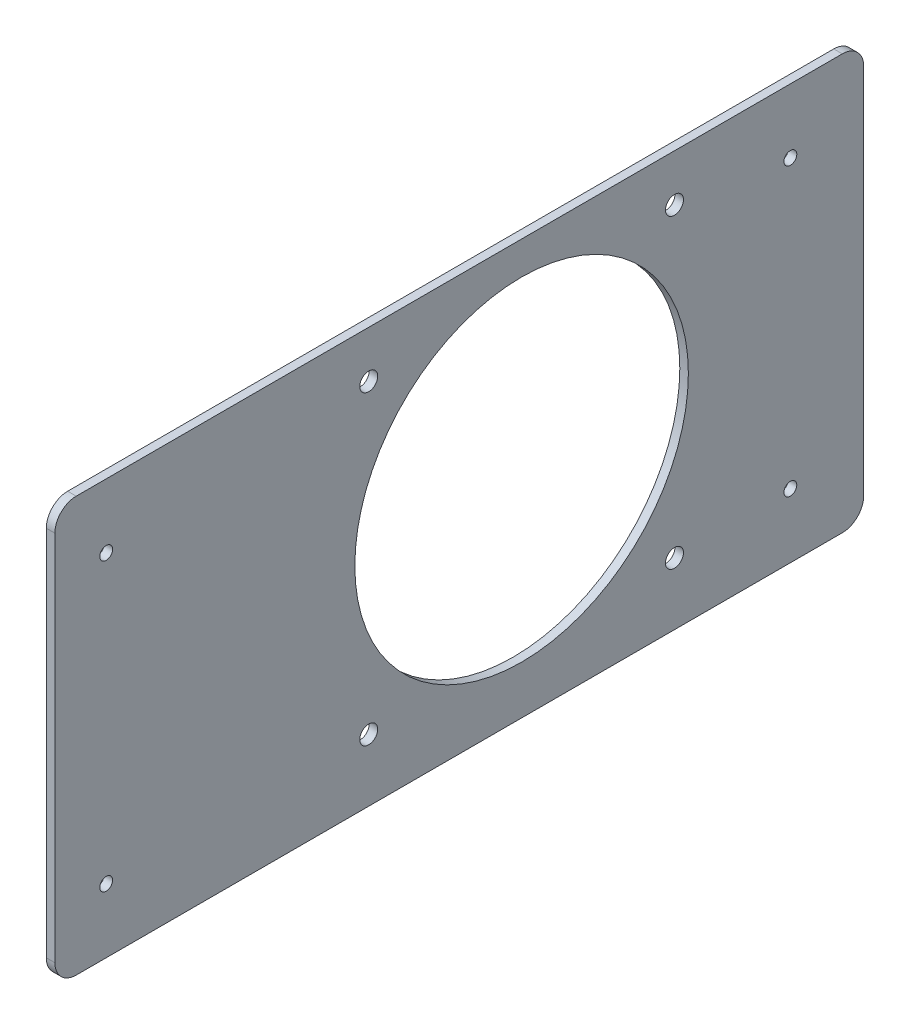
ISO-10303-21;
HEADER;
FILE_DESCRIPTION(('STEP AP214'),'2;1');
FILE_NAME('part.step','',(''),(''),'','','');
FILE_SCHEMA(('AUTOMOTIVE_DESIGN { 1 0 10303 214 1 1 1 1 }'));
ENDSEC;
DATA;
#1=APPLICATION_CONTEXT('core data for automotive mechanical design processes');
#2=APPLICATION_PROTOCOL_DEFINITION('international standard','automotive_design',2000,#1);
#3=PRODUCT_CONTEXT('',#1,'mechanical');
#4=PRODUCT('Part','Part','',(#3));
#5=PRODUCT_RELATED_PRODUCT_CATEGORY('part','',(#4));
#6=PRODUCT_DEFINITION_FORMATION('','',#4);
#7=PRODUCT_DEFINITION_CONTEXT('part definition',#1,'design');
#8=PRODUCT_DEFINITION('design','',#6,#7);
#9=PRODUCT_DEFINITION_SHAPE('','',#8);
#10=(LENGTH_UNIT() NAMED_UNIT(*) SI_UNIT(.MILLI.,.METRE.));
#11=(NAMED_UNIT(*) PLANE_ANGLE_UNIT() SI_UNIT($,.RADIAN.));
#12=(NAMED_UNIT(*) SI_UNIT($,.STERADIAN.) SOLID_ANGLE_UNIT());
#13=UNCERTAINTY_MEASURE_WITH_UNIT(LENGTH_MEASURE(1.E-05),#10,'distance_accuracy_value','');
#14=(GEOMETRIC_REPRESENTATION_CONTEXT(3) GLOBAL_UNCERTAINTY_ASSIGNED_CONTEXT((#13)) GLOBAL_UNIT_ASSIGNED_CONTEXT((#10,
#11,#12)) REPRESENTATION_CONTEXT('',''));
#15=CARTESIAN_POINT('',(0.,0.,0.));
#16=DIRECTION('',(0.,0.,1.));
#17=DIRECTION('',(1.,0.,0.));
#18=AXIS2_PLACEMENT_3D('',#15,#16,#17);
#19=CARTESIAN_POINT('',(-2.,-3.,-125.));
#20=DIRECTION('',(0.,0.,-1.));
#21=DIRECTION('',(0.,1.,0.));
#22=AXIS2_PLACEMENT_3D('',#19,#20,#21);
#23=PLANE('',#22);
#24=DIRECTION('',(0.,1.,0.));
#25=VECTOR('',#24,1.);
#26=CARTESIAN_POINT('',(-2.,-3.,-125.));
#27=LINE('',#26,#25);
#28=CARTESIAN_POINT('',(-2.,2.,-125.));
#29=VERTEX_POINT('',#28);
#30=CARTESIAN_POINT('',(-2.,89.,-125.));
#31=VERTEX_POINT('',#30);
#32=EDGE_CURVE('E187',#29,#31,#27,.T.);
#33=ORIENTED_EDGE('',*,*,#32,.T.);
#34=DIRECTION('',(1.,0.,0.));
#35=VECTOR('',#34,1.);
#36=CARTESIAN_POINT('',(-2.,89.,-125.));
#37=LINE('',#36,#35);
#38=CARTESIAN_POINT('',(0.,89.,-125.));
#39=VERTEX_POINT('',#38);
#40=EDGE_CURVE('E125',#31,#39,#37,.T.);
#41=ORIENTED_EDGE('',*,*,#40,.T.);
#42=DIRECTION('',(0.,1.,0.));
#43=VECTOR('',#42,1.);
#44=CARTESIAN_POINT('',(0.,-3.,-125.));
#45=LINE('',#44,#43);
#46=CARTESIAN_POINT('',(0.,2.,-125.));
#47=VERTEX_POINT('',#46);
#48=EDGE_CURVE('E117',#47,#39,#45,.T.);
#49=ORIENTED_EDGE('',*,*,#48,.F.);
#50=DIRECTION('',(1.,0.,0.));
#51=VECTOR('',#50,1.);
#52=CARTESIAN_POINT('',(-2.,2.,-125.));
#53=LINE('',#52,#51);
#54=EDGE_CURVE('E130',#47,#29,#53,.F.);
#55=ORIENTED_EDGE('',*,*,#54,.T.);
#56=EDGE_LOOP('',(#33,#41,#49,#55));
#57=FACE_BOUND('',#56,.T.);
#58=ADVANCED_FACE('F45',(#57),#23,.T.);
#59=CARTESIAN_POINT('',(-2.,-3.,64.1471528727021));
#60=DIRECTION('',(0.,-1.,0.));
#61=DIRECTION('',(0.,0.,-1.));
#62=AXIS2_PLACEMENT_3D('',#59,#60,#61);
#63=PLANE('',#62);
#64=DIRECTION('',(0.,0.,-1.));
#65=VECTOR('',#64,1.);
#66=CARTESIAN_POINT('',(0.,-3.,64.1471528727021));
#67=LINE('',#66,#65);
#68=CARTESIAN_POINT('',(0.,-3.,59.1471528727021));
#69=VERTEX_POINT('',#68);
#70=CARTESIAN_POINT('',(0.,-3.,-120.));
#71=VERTEX_POINT('',#70);
#72=EDGE_CURVE('E119',#69,#71,#67,.T.);
#73=ORIENTED_EDGE('',*,*,#72,.F.);
#74=DIRECTION('',(1.,0.,0.));
#75=VECTOR('',#74,1.);
#76=CARTESIAN_POINT('',(-2.,-3.,59.1471528727021));
#77=LINE('',#76,#75);
#78=CARTESIAN_POINT('',(-2.,-3.,59.1471528727021));
#79=VERTEX_POINT('',#78);
#80=EDGE_CURVE('E11',#69,#79,#77,.F.);
#81=ORIENTED_EDGE('',*,*,#80,.T.);
#82=DIRECTION('',(0.,0.,-1.));
#83=VECTOR('',#82,1.);
#84=CARTESIAN_POINT('',(-2.,-3.,64.1471528727021));
#85=LINE('',#84,#83);
#86=CARTESIAN_POINT('',(-2.,-3.,-120.));
#87=VERTEX_POINT('',#86);
#88=EDGE_CURVE('E139',#79,#87,#85,.T.);
#89=ORIENTED_EDGE('',*,*,#88,.T.);
#90=DIRECTION('',(1.,0.,0.));
#91=VECTOR('',#90,1.);
#92=CARTESIAN_POINT('',(-2.,-3.,-120.));
#93=LINE('',#92,#91);
#94=EDGE_CURVE('E53',#87,#71,#93,.T.);
#95=ORIENTED_EDGE('',*,*,#94,.T.);
#96=EDGE_LOOP('',(#73,#81,#89,#95));
#97=FACE_BOUND('',#96,.T.);
#98=ADVANCED_FACE('F173',(#97),#63,.T.);
#99=CARTESIAN_POINT('',(-2.,94.,64.1471528727021));
#100=DIRECTION('',(0.,0.,1.));
#101=DIRECTION('',(1.,0.,0.));
#102=AXIS2_PLACEMENT_3D('',#99,#100,#101);
#103=PLANE('',#102);
#104=DIRECTION('',(0.,-1.,0.));
#105=VECTOR('',#104,1.);
#106=CARTESIAN_POINT('',(0.,94.,64.1471528727021));
#107=LINE('',#106,#105);
#108=CARTESIAN_POINT('',(0.,89.,64.1471528727021));
#109=VERTEX_POINT('',#108);
#110=CARTESIAN_POINT('',(0.,2.,64.1471528727021));
#111=VERTEX_POINT('',#110);
#112=EDGE_CURVE('E182',#109,#111,#107,.T.);
#113=ORIENTED_EDGE('',*,*,#112,.F.);
#114=DIRECTION('',(1.,0.,0.));
#115=VECTOR('',#114,1.);
#116=CARTESIAN_POINT('',(-2.,89.,64.1471528727021));
#117=LINE('',#116,#115);
#118=CARTESIAN_POINT('',(-2.,89.,64.1471528727021));
#119=VERTEX_POINT('',#118);
#120=EDGE_CURVE('E67',#109,#119,#117,.F.);
#121=ORIENTED_EDGE('',*,*,#120,.T.);
#122=DIRECTION('',(0.,-1.,0.));
#123=VECTOR('',#122,1.);
#124=CARTESIAN_POINT('',(-2.,94.,64.1471528727021));
#125=LINE('',#124,#123);
#126=CARTESIAN_POINT('',(-2.,2.,64.1471528727021));
#127=VERTEX_POINT('',#126);
#128=EDGE_CURVE('E145',#119,#127,#125,.T.);
#129=ORIENTED_EDGE('',*,*,#128,.T.);
#130=DIRECTION('',(1.,0.,0.));
#131=VECTOR('',#130,1.);
#132=CARTESIAN_POINT('',(-2.,2.,64.1471528727021));
#133=LINE('',#132,#131);
#134=EDGE_CURVE('E169',#127,#111,#133,.T.);
#135=ORIENTED_EDGE('',*,*,#134,.T.);
#136=EDGE_LOOP('',(#113,#121,#129,#135));
#137=FACE_BOUND('',#136,.T.);
#138=ADVANCED_FACE('F181',(#137),#103,.T.);
#139=CARTESIAN_POINT('',(-2.,94.,-125.));
#140=DIRECTION('',(0.,1.,0.));
#141=DIRECTION('',(0.,0.,1.));
#142=AXIS2_PLACEMENT_3D('',#139,#140,#141);
#143=PLANE('',#142);
#144=DIRECTION('',(0.,0.,1.));
#145=VECTOR('',#144,1.);
#146=CARTESIAN_POINT('',(0.,94.,-125.));
#147=LINE('',#146,#145);
#148=CARTESIAN_POINT('',(0.,94.,-120.));
#149=VERTEX_POINT('',#148);
#150=CARTESIAN_POINT('',(0.,94.,59.147152872702));
#151=VERTEX_POINT('',#150);
#152=EDGE_CURVE('E134',#149,#151,#147,.T.);
#153=ORIENTED_EDGE('',*,*,#152,.F.);
#154=DIRECTION('',(1.,0.,0.));
#155=VECTOR('',#154,1.);
#156=CARTESIAN_POINT('',(-2.,94.,-120.));
#157=LINE('',#156,#155);
#158=CARTESIAN_POINT('',(-2.,94.,-120.));
#159=VERTEX_POINT('',#158);
#160=EDGE_CURVE('E159',#149,#159,#157,.F.);
#161=ORIENTED_EDGE('',*,*,#160,.T.);
#162=DIRECTION('',(0.,0.,1.));
#163=VECTOR('',#162,1.);
#164=CARTESIAN_POINT('',(-2.,94.,-125.));
#165=LINE('',#164,#163);
#166=CARTESIAN_POINT('',(-2.,94.,59.147152872702));
#167=VERTEX_POINT('',#166);
#168=EDGE_CURVE('E193',#159,#167,#165,.T.);
#169=ORIENTED_EDGE('',*,*,#168,.T.);
#170=DIRECTION('',(1.,0.,0.));
#171=VECTOR('',#170,1.);
#172=CARTESIAN_POINT('',(-2.,94.,59.1471528727021));
#173=LINE('',#172,#171);
#174=EDGE_CURVE('E156',#167,#151,#173,.T.);
#175=ORIENTED_EDGE('',*,*,#174,.T.);
#176=EDGE_LOOP('',(#153,#161,#169,#175));
#177=FACE_BOUND('',#176,.T.);
#178=ADVANCED_FACE('F291',(#177),#143,.T.);
#179=CARTESIAN_POINT('',(-2.,0.,0.));
#180=DIRECTION('',(1.,0.,0.));
#181=DIRECTION('',(0.,0.,-1.));
#182=AXIS2_PLACEMENT_3D('',#179,#180,#181);
#183=PLANE('',#182);
#184=CARTESIAN_POINT('',(-2.,79.,-107.852847127298));
#185=DIRECTION('',(1.,0.,0.));
#186=DIRECTION('',(0.,0.,-1.));
#187=AXIS2_PLACEMENT_3D('',#184,#185,#186);
#188=CIRCLE('',#187,1.50000000000003);
#189=CARTESIAN_POINT('',(-2.,79.,-109.352847127298));
#190=VERTEX_POINT('',#189);
#191=EDGE_CURVE('E245',#190,#190,#188,.T.);
#192=ORIENTED_EDGE('',*,*,#191,.T.);
#193=EDGE_LOOP('',(#192));
#194=FACE_BOUND('',#193,.T.);
#195=CARTESIAN_POINT('',(-2.,12.,-107.852847127298));
#196=DIRECTION('',(1.,0.,0.));
#197=DIRECTION('',(0.,0.,-1.));
#198=AXIS2_PLACEMENT_3D('',#195,#196,#197);
#199=CIRCLE('',#198,1.50000000000003);
#200=CARTESIAN_POINT('',(-2.,12.,-109.352847127298));
#201=VERTEX_POINT('',#200);
#202=EDGE_CURVE('E250',#201,#201,#199,.T.);
#203=ORIENTED_EDGE('',*,*,#202,.T.);
#204=EDGE_LOOP('',(#203));
#205=FACE_BOUND('',#204,.T.);
#206=CARTESIAN_POINT('',(-2.,12.,52.1471528727021));
#207=DIRECTION('',(1.,0.,0.));
#208=DIRECTION('',(0.,0.,-1.));
#209=AXIS2_PLACEMENT_3D('',#206,#207,#208);
#210=CIRCLE('',#209,1.5);
#211=CARTESIAN_POINT('',(-2.,12.,50.6471528727021));
#212=VERTEX_POINT('',#211);
#213=EDGE_CURVE('E229',#212,#212,#210,.T.);
#214=ORIENTED_EDGE('',*,*,#213,.T.);
#215=EDGE_LOOP('',(#214));
#216=FACE_BOUND('',#215,.T.);
#217=CARTESIAN_POINT('',(-2.,79.,52.1471528727021));
#218=DIRECTION('',(1.,0.,0.));
#219=DIRECTION('',(0.,0.,-1.));
#220=AXIS2_PLACEMENT_3D('',#217,#218,#219);
#221=CIRCLE('',#220,1.5);
#222=CARTESIAN_POINT('',(-2.,79.,50.6471528727021));
#223=VERTEX_POINT('',#222);
#224=EDGE_CURVE('E237',#223,#223,#221,.T.);
#225=ORIENTED_EDGE('',*,*,#224,.T.);
#226=EDGE_LOOP('',(#225));
#227=FACE_BOUND('',#226,.T.);
#228=CARTESIAN_POINT('',(-2.,11.55,-9.24999999999999));
#229=DIRECTION('',(1.,0.,0.));
#230=DIRECTION('',(0.,0.,-1.));
#231=AXIS2_PLACEMENT_3D('',#228,#229,#230);
#232=CIRCLE('',#231,2.1);
#233=CARTESIAN_POINT('',(-2.,11.55,-11.35));
#234=VERTEX_POINT('',#233);
#235=EDGE_CURVE('E214',#234,#234,#232,.T.);
#236=ORIENTED_EDGE('',*,*,#235,.T.);
#237=EDGE_LOOP('',(#236));
#238=FACE_BOUND('',#237,.T.);
#239=CARTESIAN_POINT('',(-2.,11.55,-80.75));
#240=DIRECTION('',(1.,0.,0.));
#241=DIRECTION('',(0.,0.,-1.));
#242=AXIS2_PLACEMENT_3D('',#239,#240,#241);
#243=CIRCLE('',#242,2.1);
#244=CARTESIAN_POINT('',(-2.,11.55,-82.85));
#245=VERTEX_POINT('',#244);
#246=EDGE_CURVE('E217',#245,#245,#243,.T.);
#247=ORIENTED_EDGE('',*,*,#246,.T.);
#248=EDGE_LOOP('',(#247));
#249=FACE_BOUND('',#248,.T.);
#250=CARTESIAN_POINT('',(-2.,83.05,-80.75));
#251=DIRECTION('',(1.,0.,0.));
#252=DIRECTION('',(0.,0.,-1.));
#253=AXIS2_PLACEMENT_3D('',#250,#251,#252);
#254=CIRCLE('',#253,2.1);
#255=CARTESIAN_POINT('',(-2.,83.05,-82.85));
#256=VERTEX_POINT('',#255);
#257=EDGE_CURVE('E220',#256,#256,#254,.T.);
#258=ORIENTED_EDGE('',*,*,#257,.T.);
#259=EDGE_LOOP('',(#258));
#260=FACE_BOUND('',#259,.T.);
#261=CARTESIAN_POINT('',(-2.,83.05,-9.24999999999999));
#262=DIRECTION('',(1.,0.,0.));
#263=DIRECTION('',(0.,0.,-1.));
#264=AXIS2_PLACEMENT_3D('',#261,#262,#263);
#265=CIRCLE('',#264,2.1);
#266=CARTESIAN_POINT('',(-2.,83.05,-11.35));
#267=VERTEX_POINT('',#266);
#268=EDGE_CURVE('E206',#267,#267,#265,.T.);
#269=ORIENTED_EDGE('',*,*,#268,.T.);
#270=EDGE_LOOP('',(#269));
#271=FACE_BOUND('',#270,.T.);
#272=CARTESIAN_POINT('',(-2.,47.3,-45.));
#273=DIRECTION('',(1.,0.,0.));
#274=DIRECTION('',(0.,0.,-1.));
#275=AXIS2_PLACEMENT_3D('',#272,#273,#274);
#276=CIRCLE('',#275,39.);
#277=CARTESIAN_POINT('',(-2.,47.3,-84.));
#278=VERTEX_POINT('',#277);
#279=EDGE_CURVE('E135',#278,#278,#276,.T.);
#280=ORIENTED_EDGE('',*,*,#279,.T.);
#281=EDGE_LOOP('',(#280));
#282=FACE_BOUND('',#281,.T.);
#283=ORIENTED_EDGE('',*,*,#168,.F.);
#284=CARTESIAN_POINT('',(-2.,89.,-120.));
#285=DIRECTION('',(1.,0.,0.));
#286=DIRECTION('',(0.,0.,-1.));
#287=AXIS2_PLACEMENT_3D('',#284,#285,#286);
#288=CIRCLE('',#287,5.);
#289=EDGE_CURVE('E166',#159,#31,#288,.F.);
#290=ORIENTED_EDGE('',*,*,#289,.T.);
#291=ORIENTED_EDGE('',*,*,#32,.F.);
#292=CARTESIAN_POINT('',(-2.,2.,-120.));
#293=DIRECTION('',(1.,0.,0.));
#294=DIRECTION('',(0.,0.,-1.));
#295=AXIS2_PLACEMENT_3D('',#292,#293,#294);
#296=CIRCLE('',#295,5.);
#297=EDGE_CURVE('E138',#29,#87,#296,.F.);
#298=ORIENTED_EDGE('',*,*,#297,.T.);
#299=ORIENTED_EDGE('',*,*,#88,.F.);
#300=CARTESIAN_POINT('',(-2.,2.,59.1471528727021));
#301=DIRECTION('',(1.,0.,0.));
#302=DIRECTION('',(0.,0.,-1.));
#303=AXIS2_PLACEMENT_3D('',#300,#301,#302);
#304=CIRCLE('',#303,5.);
#305=EDGE_CURVE('E60',#79,#127,#304,.F.);
#306=ORIENTED_EDGE('',*,*,#305,.T.);
#307=ORIENTED_EDGE('',*,*,#128,.F.);
#308=CARTESIAN_POINT('',(-2.,89.,59.1471528727021));
#309=DIRECTION('',(1.,0.,0.));
#310=DIRECTION('',(0.,0.,-1.));
#311=AXIS2_PLACEMENT_3D('',#308,#309,#310);
#312=CIRCLE('',#311,5.);
#313=EDGE_CURVE('E164',#119,#167,#312,.F.);
#314=ORIENTED_EDGE('',*,*,#313,.T.);
#315=EDGE_LOOP('',(#283,#290,#291,#298,#299,#306,#307,#314));
#316=FACE_BOUND('',#315,.T.);
#317=ADVANCED_FACE('F176',(#194,#205,#216,#227,#238,#249,#260,#271,#282,#316),#183,.F.);
#318=CARTESIAN_POINT('',(0.,0.,0.));
#319=DIRECTION('',(1.,0.,0.));
#320=DIRECTION('',(0.,0.,-1.));
#321=AXIS2_PLACEMENT_3D('',#318,#319,#320);
#322=PLANE('',#321);
#323=CARTESIAN_POINT('',(0.,79.,-107.852847127298));
#324=DIRECTION('',(1.,0.,0.));
#325=DIRECTION('',(0.,0.,-1.));
#326=AXIS2_PLACEMENT_3D('',#323,#324,#325);
#327=CIRCLE('',#326,1.50000000000003);
#328=CARTESIAN_POINT('',(0.,79.,-109.352847127298));
#329=VERTEX_POINT('',#328);
#330=EDGE_CURVE('E253',#329,#329,#327,.T.);
#331=ORIENTED_EDGE('',*,*,#330,.F.);
#332=EDGE_LOOP('',(#331));
#333=FACE_BOUND('',#332,.T.);
#334=CARTESIAN_POINT('',(0.,12.,-107.852847127298));
#335=DIRECTION('',(1.,0.,0.));
#336=DIRECTION('',(0.,0.,-1.));
#337=AXIS2_PLACEMENT_3D('',#334,#335,#336);
#338=CIRCLE('',#337,1.50000000000003);
#339=CARTESIAN_POINT('',(0.,12.,-109.352847127298));
#340=VERTEX_POINT('',#339);
#341=EDGE_CURVE('E254',#340,#340,#338,.T.);
#342=ORIENTED_EDGE('',*,*,#341,.F.);
#343=EDGE_LOOP('',(#342));
#344=FACE_BOUND('',#343,.T.);
#345=CARTESIAN_POINT('',(0.,12.,52.1471528727021));
#346=DIRECTION('',(1.,0.,0.));
#347=DIRECTION('',(0.,0.,-1.));
#348=AXIS2_PLACEMENT_3D('',#345,#346,#347);
#349=CIRCLE('',#348,1.5);
#350=CARTESIAN_POINT('',(0.,12.,50.6471528727021));
#351=VERTEX_POINT('',#350);
#352=EDGE_CURVE('E241',#351,#351,#349,.T.);
#353=ORIENTED_EDGE('',*,*,#352,.F.);
#354=EDGE_LOOP('',(#353));
#355=FACE_BOUND('',#354,.T.);
#356=CARTESIAN_POINT('',(0.,79.,52.1471528727021));
#357=DIRECTION('',(1.,0.,0.));
#358=DIRECTION('',(0.,0.,-1.));
#359=AXIS2_PLACEMENT_3D('',#356,#357,#358);
#360=CIRCLE('',#359,1.5);
#361=CARTESIAN_POINT('',(0.,79.,50.6471528727021));
#362=VERTEX_POINT('',#361);
#363=EDGE_CURVE('E242',#362,#362,#360,.T.);
#364=ORIENTED_EDGE('',*,*,#363,.F.);
#365=EDGE_LOOP('',(#364));
#366=FACE_BOUND('',#365,.T.);
#367=CARTESIAN_POINT('',(0.,11.55,-9.24999999999999));
#368=DIRECTION('',(1.,0.,0.));
#369=DIRECTION('',(0.,0.,-1.));
#370=AXIS2_PLACEMENT_3D('',#367,#368,#369);
#371=CIRCLE('',#370,2.1);
#372=CARTESIAN_POINT('',(0.,11.55,-11.35));
#373=VERTEX_POINT('',#372);
#374=EDGE_CURVE('E225',#373,#373,#371,.T.);
#375=ORIENTED_EDGE('',*,*,#374,.F.);
#376=EDGE_LOOP('',(#375));
#377=FACE_BOUND('',#376,.T.);
#378=CARTESIAN_POINT('',(0.,11.55,-80.75));
#379=DIRECTION('',(1.,0.,0.));
#380=DIRECTION('',(0.,0.,-1.));
#381=AXIS2_PLACEMENT_3D('',#378,#379,#380);
#382=CIRCLE('',#381,2.1);
#383=CARTESIAN_POINT('',(0.,11.55,-82.85));
#384=VERTEX_POINT('',#383);
#385=EDGE_CURVE('E228',#384,#384,#382,.T.);
#386=ORIENTED_EDGE('',*,*,#385,.F.);
#387=EDGE_LOOP('',(#386));
#388=FACE_BOUND('',#387,.T.);
#389=CARTESIAN_POINT('',(0.,83.05,-80.75));
#390=DIRECTION('',(1.,0.,0.));
#391=DIRECTION('',(0.,0.,-1.));
#392=AXIS2_PLACEMENT_3D('',#389,#390,#391);
#393=CIRCLE('',#392,2.1);
#394=CARTESIAN_POINT('',(0.,83.05,-82.85));
#395=VERTEX_POINT('',#394);
#396=EDGE_CURVE('E224',#395,#395,#393,.T.);
#397=ORIENTED_EDGE('',*,*,#396,.F.);
#398=EDGE_LOOP('',(#397));
#399=FACE_BOUND('',#398,.T.);
#400=CARTESIAN_POINT('',(0.,83.05,-9.24999999999999));
#401=DIRECTION('',(1.,0.,0.));
#402=DIRECTION('',(0.,0.,-1.));
#403=AXIS2_PLACEMENT_3D('',#400,#401,#402);
#404=CIRCLE('',#403,2.1);
#405=CARTESIAN_POINT('',(0.,83.05,-11.35));
#406=VERTEX_POINT('',#405);
#407=EDGE_CURVE('E210',#406,#406,#404,.T.);
#408=ORIENTED_EDGE('',*,*,#407,.F.);
#409=EDGE_LOOP('',(#408));
#410=FACE_BOUND('',#409,.T.);
#411=CARTESIAN_POINT('',(0.,47.3,-45.));
#412=DIRECTION('',(1.,0.,0.));
#413=DIRECTION('',(0.,0.,-1.));
#414=AXIS2_PLACEMENT_3D('',#411,#412,#413);
#415=CIRCLE('',#414,39.);
#416=CARTESIAN_POINT('',(0.,47.3,-84.));
#417=VERTEX_POINT('',#416);
#418=EDGE_CURVE('E202',#417,#417,#415,.T.);
#419=ORIENTED_EDGE('',*,*,#418,.F.);
#420=EDGE_LOOP('',(#419));
#421=FACE_BOUND('',#420,.T.);
#422=ORIENTED_EDGE('',*,*,#48,.T.);
#423=CARTESIAN_POINT('',(0.,89.,-120.));
#424=DIRECTION('',(1.,0.,0.));
#425=DIRECTION('',(0.,0.,-1.));
#426=AXIS2_PLACEMENT_3D('',#423,#424,#425);
#427=CIRCLE('',#426,5.);
#428=EDGE_CURVE('E153',#39,#149,#427,.T.);
#429=ORIENTED_EDGE('',*,*,#428,.T.);
#430=ORIENTED_EDGE('',*,*,#152,.T.);
#431=CARTESIAN_POINT('',(0.,89.,59.1471528727021));
#432=DIRECTION('',(1.,0.,0.));
#433=DIRECTION('',(0.,0.,-1.));
#434=AXIS2_PLACEMENT_3D('',#431,#432,#433);
#435=CIRCLE('',#434,5.);
#436=EDGE_CURVE('E151',#151,#109,#435,.T.);
#437=ORIENTED_EDGE('',*,*,#436,.T.);
#438=ORIENTED_EDGE('',*,*,#112,.T.);
#439=CARTESIAN_POINT('',(0.,2.,59.1471528727021));
#440=DIRECTION('',(1.,0.,0.));
#441=DIRECTION('',(0.,0.,-1.));
#442=AXIS2_PLACEMENT_3D('',#439,#440,#441);
#443=CIRCLE('',#442,5.);
#444=EDGE_CURVE('E124',#111,#69,#443,.T.);
#445=ORIENTED_EDGE('',*,*,#444,.T.);
#446=ORIENTED_EDGE('',*,*,#72,.T.);
#447=CARTESIAN_POINT('',(0.,2.,-120.));
#448=DIRECTION('',(1.,0.,0.));
#449=DIRECTION('',(0.,0.,-1.));
#450=AXIS2_PLACEMENT_3D('',#447,#448,#449);
#451=CIRCLE('',#450,5.);
#452=EDGE_CURVE('E114',#71,#47,#451,.T.);
#453=ORIENTED_EDGE('',*,*,#452,.T.);
#454=EDGE_LOOP('',(#422,#429,#430,#437,#438,#445,#446,#453));
#455=FACE_BOUND('',#454,.T.);
#456=ADVANCED_FACE('F116',(#333,#344,#355,#366,#377,#388,#399,#410,#421,#455),#322,.T.);
#457=CARTESIAN_POINT('',(-2.,89.,-120.));
#458=DIRECTION('',(1.,0.,0.));
#459=DIRECTION('',(0.,0.,-1.));
#460=AXIS2_PLACEMENT_3D('',#457,#458,#459);
#461=CYLINDRICAL_SURFACE('',#460,5.);
#462=ORIENTED_EDGE('',*,*,#289,.F.);
#463=ORIENTED_EDGE('',*,*,#160,.F.);
#464=ORIENTED_EDGE('',*,*,#428,.F.);
#465=ORIENTED_EDGE('',*,*,#40,.F.);
#466=EDGE_LOOP('',(#462,#463,#464,#465));
#467=FACE_BOUND('',#466,.T.);
#468=ADVANCED_FACE('F265',(#467),#461,.T.);
#469=CARTESIAN_POINT('',(-2.,89.,59.1471528727021));
#470=DIRECTION('',(1.,0.,0.));
#471=DIRECTION('',(0.,0.,-1.));
#472=AXIS2_PLACEMENT_3D('',#469,#470,#471);
#473=CYLINDRICAL_SURFACE('',#472,5.);
#474=ORIENTED_EDGE('',*,*,#313,.F.);
#475=ORIENTED_EDGE('',*,*,#120,.F.);
#476=ORIENTED_EDGE('',*,*,#436,.F.);
#477=ORIENTED_EDGE('',*,*,#174,.F.);
#478=EDGE_LOOP('',(#474,#475,#476,#477));
#479=FACE_BOUND('',#478,.T.);
#480=ADVANCED_FACE('F310',(#479),#473,.T.);
#481=CARTESIAN_POINT('',(-2.,2.,59.1471528727021));
#482=DIRECTION('',(1.,0.,0.));
#483=DIRECTION('',(0.,0.,-1.));
#484=AXIS2_PLACEMENT_3D('',#481,#482,#483);
#485=CYLINDRICAL_SURFACE('',#484,5.);
#486=ORIENTED_EDGE('',*,*,#305,.F.);
#487=ORIENTED_EDGE('',*,*,#80,.F.);
#488=ORIENTED_EDGE('',*,*,#444,.F.);
#489=ORIENTED_EDGE('',*,*,#134,.F.);
#490=EDGE_LOOP('',(#486,#487,#488,#489));
#491=FACE_BOUND('',#490,.T.);
#492=ADVANCED_FACE('F179',(#491),#485,.T.);
#493=CARTESIAN_POINT('',(-2.,2.,-120.));
#494=DIRECTION('',(1.,0.,0.));
#495=DIRECTION('',(0.,0.,-1.));
#496=AXIS2_PLACEMENT_3D('',#493,#494,#495);
#497=CYLINDRICAL_SURFACE('',#496,5.);
#498=ORIENTED_EDGE('',*,*,#297,.F.);
#499=ORIENTED_EDGE('',*,*,#54,.F.);
#500=ORIENTED_EDGE('',*,*,#452,.F.);
#501=ORIENTED_EDGE('',*,*,#94,.F.);
#502=EDGE_LOOP('',(#498,#499,#500,#501));
#503=FACE_BOUND('',#502,.T.);
#504=ADVANCED_FACE('F47',(#503),#497,.T.);
#505=CARTESIAN_POINT('',(-10.,47.3,-45.));
#506=DIRECTION('',(1.,0.,0.));
#507=DIRECTION('',(0.,0.,-1.));
#508=AXIS2_PLACEMENT_3D('',#505,#506,#507);
#509=CYLINDRICAL_SURFACE('',#508,39.);
#510=ORIENTED_EDGE('',*,*,#418,.T.);
#511=EDGE_LOOP('',(#510));
#512=FACE_BOUND('',#511,.T.);
#513=ORIENTED_EDGE('',*,*,#279,.F.);
#514=EDGE_LOOP('',(#513));
#515=FACE_BOUND('',#514,.T.);
#516=ADVANCED_FACE('F283',(#512,#515),#509,.F.);
#517=CARTESIAN_POINT('',(-10.,83.05,-9.24999999999999));
#518=DIRECTION('',(1.,0.,0.));
#519=DIRECTION('',(0.,0.,-1.));
#520=AXIS2_PLACEMENT_3D('',#517,#518,#519);
#521=CYLINDRICAL_SURFACE('',#520,2.1);
#522=ORIENTED_EDGE('',*,*,#407,.T.);
#523=EDGE_LOOP('',(#522));
#524=FACE_BOUND('',#523,.T.);
#525=ORIENTED_EDGE('',*,*,#268,.F.);
#526=EDGE_LOOP('',(#525));
#527=FACE_BOUND('',#526,.T.);
#528=ADVANCED_FACE('F286',(#524,#527),#521,.F.);
#529=CARTESIAN_POINT('',(-10.,83.05,-80.75));
#530=DIRECTION('',(1.,0.,0.));
#531=DIRECTION('',(0.,0.,-1.));
#532=AXIS2_PLACEMENT_3D('',#529,#530,#531);
#533=CYLINDRICAL_SURFACE('',#532,2.1);
#534=ORIENTED_EDGE('',*,*,#396,.T.);
#535=EDGE_LOOP('',(#534));
#536=FACE_BOUND('',#535,.T.);
#537=ORIENTED_EDGE('',*,*,#257,.F.);
#538=EDGE_LOOP('',(#537));
#539=FACE_BOUND('',#538,.T.);
#540=ADVANCED_FACE('F330',(#536,#539),#533,.F.);
#541=CARTESIAN_POINT('',(-10.,11.55,-80.75));
#542=DIRECTION('',(1.,0.,0.));
#543=DIRECTION('',(0.,0.,-1.));
#544=AXIS2_PLACEMENT_3D('',#541,#542,#543);
#545=CYLINDRICAL_SURFACE('',#544,2.1);
#546=ORIENTED_EDGE('',*,*,#385,.T.);
#547=EDGE_LOOP('',(#546));
#548=FACE_BOUND('',#547,.T.);
#549=ORIENTED_EDGE('',*,*,#246,.F.);
#550=EDGE_LOOP('',(#549));
#551=FACE_BOUND('',#550,.T.);
#552=ADVANCED_FACE('F338',(#548,#551),#545,.F.);
#553=CARTESIAN_POINT('',(-10.,11.55,-9.24999999999999));
#554=DIRECTION('',(1.,0.,0.));
#555=DIRECTION('',(0.,0.,-1.));
#556=AXIS2_PLACEMENT_3D('',#553,#554,#555);
#557=CYLINDRICAL_SURFACE('',#556,2.1);
#558=ORIENTED_EDGE('',*,*,#374,.T.);
#559=EDGE_LOOP('',(#558));
#560=FACE_BOUND('',#559,.T.);
#561=ORIENTED_EDGE('',*,*,#235,.F.);
#562=EDGE_LOOP('',(#561));
#563=FACE_BOUND('',#562,.T.);
#564=ADVANCED_FACE('F346',(#560,#563),#557,.F.);
#565=CARTESIAN_POINT('',(-10.,79.,52.1471528727021));
#566=DIRECTION('',(1.,0.,0.));
#567=DIRECTION('',(0.,0.,-1.));
#568=AXIS2_PLACEMENT_3D('',#565,#566,#567);
#569=CYLINDRICAL_SURFACE('',#568,1.5);
#570=ORIENTED_EDGE('',*,*,#363,.T.);
#571=EDGE_LOOP('',(#570));
#572=FACE_BOUND('',#571,.T.);
#573=ORIENTED_EDGE('',*,*,#224,.F.);
#574=EDGE_LOOP('',(#573));
#575=FACE_BOUND('',#574,.T.);
#576=ADVANCED_FACE('F354',(#572,#575),#569,.F.);
#577=CARTESIAN_POINT('',(-10.,12.,52.1471528727021));
#578=DIRECTION('',(1.,0.,0.));
#579=DIRECTION('',(0.,0.,-1.));
#580=AXIS2_PLACEMENT_3D('',#577,#578,#579);
#581=CYLINDRICAL_SURFACE('',#580,1.5);
#582=ORIENTED_EDGE('',*,*,#352,.T.);
#583=EDGE_LOOP('',(#582));
#584=FACE_BOUND('',#583,.T.);
#585=ORIENTED_EDGE('',*,*,#213,.F.);
#586=EDGE_LOOP('',(#585));
#587=FACE_BOUND('',#586,.T.);
#588=ADVANCED_FACE('F362',(#584,#587),#581,.F.);
#589=CARTESIAN_POINT('',(-10.,12.,-107.852847127298));
#590=DIRECTION('',(1.,0.,0.));
#591=DIRECTION('',(0.,0.,-1.));
#592=AXIS2_PLACEMENT_3D('',#589,#590,#591);
#593=CYLINDRICAL_SURFACE('',#592,1.50000000000003);
#594=ORIENTED_EDGE('',*,*,#341,.T.);
#595=EDGE_LOOP('',(#594));
#596=FACE_BOUND('',#595,.T.);
#597=ORIENTED_EDGE('',*,*,#202,.F.);
#598=EDGE_LOOP('',(#597));
#599=FACE_BOUND('',#598,.T.);
#600=ADVANCED_FACE('F370',(#596,#599),#593,.F.);
#601=CARTESIAN_POINT('',(-10.,79.,-107.852847127298));
#602=DIRECTION('',(1.,0.,0.));
#603=DIRECTION('',(0.,0.,-1.));
#604=AXIS2_PLACEMENT_3D('',#601,#602,#603);
#605=CYLINDRICAL_SURFACE('',#604,1.50000000000003);
#606=ORIENTED_EDGE('',*,*,#330,.T.);
#607=EDGE_LOOP('',(#606));
#608=FACE_BOUND('',#607,.T.);
#609=ORIENTED_EDGE('',*,*,#191,.F.);
#610=EDGE_LOOP('',(#609));
#611=FACE_BOUND('',#610,.T.);
#612=ADVANCED_FACE('F260',(#608,#611),#605,.F.);
#613=CLOSED_SHELL('',(#58,#98,#138,#178,#317,#456,#468,#480,#492,#504,#516,#528,#540,#552,#564,
#576,#588,#600,#612));
#614=MANIFOLD_SOLID_BREP('B2',#613);
#615=ADVANCED_BREP_SHAPE_REPRESENTATION('',(#18,#614),#14);
#616=SHAPE_DEFINITION_REPRESENTATION(#9,#615);
ENDSEC;
END-ISO-10303-21;
